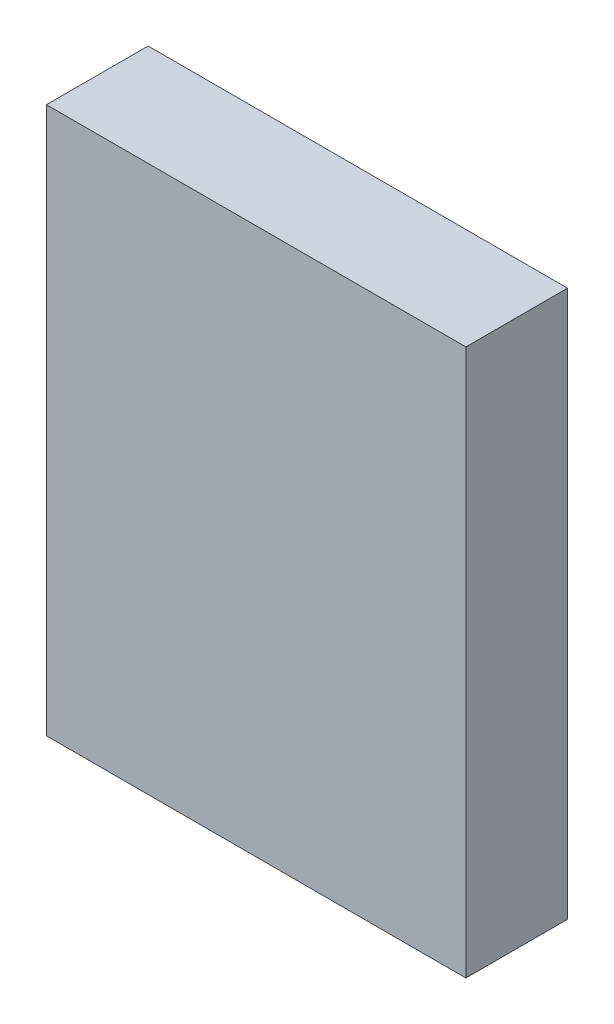
ISO-10303-21;
HEADER;
FILE_DESCRIPTION(('STEP AP214'),'2;1');
FILE_NAME('part.step','',(''),(''),'','','');
FILE_SCHEMA(('AUTOMOTIVE_DESIGN { 1 0 10303 214 1 1 1 1 }'));
ENDSEC;
DATA;
#1=APPLICATION_CONTEXT('core data for automotive mechanical design processes');
#2=APPLICATION_PROTOCOL_DEFINITION('international standard','automotive_design',2000,#1);
#3=PRODUCT_CONTEXT('',#1,'mechanical');
#4=PRODUCT('Part','Part','',(#3));
#5=PRODUCT_RELATED_PRODUCT_CATEGORY('part','',(#4));
#6=PRODUCT_DEFINITION_FORMATION('','',#4);
#7=PRODUCT_DEFINITION_CONTEXT('part definition',#1,'design');
#8=PRODUCT_DEFINITION('design','',#6,#7);
#9=PRODUCT_DEFINITION_SHAPE('','',#8);
#10=(LENGTH_UNIT() NAMED_UNIT(*) SI_UNIT(.MILLI.,.METRE.));
#11=(NAMED_UNIT(*) PLANE_ANGLE_UNIT() SI_UNIT($,.RADIAN.));
#12=(NAMED_UNIT(*) SI_UNIT($,.STERADIAN.) SOLID_ANGLE_UNIT());
#13=UNCERTAINTY_MEASURE_WITH_UNIT(LENGTH_MEASURE(1.E-05),#10,'distance_accuracy_value','');
#14=(GEOMETRIC_REPRESENTATION_CONTEXT(3) GLOBAL_UNCERTAINTY_ASSIGNED_CONTEXT((#13)) GLOBAL_UNIT_ASSIGNED_CONTEXT((#10,
#11,#12)) REPRESENTATION_CONTEXT('',''));
#15=CARTESIAN_POINT('',(0.,0.,0.));
#16=DIRECTION('',(0.,0.,1.));
#17=DIRECTION('',(1.,0.,0.));
#18=AXIS2_PLACEMENT_3D('',#15,#16,#17);
#19=CARTESIAN_POINT('',(0.,0.,12.7));
#20=DIRECTION('',(1.,0.,0.));
#21=DIRECTION('',(0.,0.,-1.));
#22=AXIS2_PLACEMENT_3D('',#19,#20,#21);
#23=PLANE('',#22);
#24=DIRECTION('',(0.,-1.,0.));
#25=VECTOR('',#24,1.);
#26=CARTESIAN_POINT('',(0.,0.,0.));
#27=LINE('',#26,#25);
#28=CARTESIAN_POINT('',(0.,68.2625,0.));
#29=VERTEX_POINT('',#28);
#30=CARTESIAN_POINT('',(0.,0.,0.));
#31=VERTEX_POINT('',#30);
#32=EDGE_CURVE('E100',#29,#31,#27,.T.);
#33=ORIENTED_EDGE('',*,*,#32,.T.);
#34=DIRECTION('',(0.,0.,-1.));
#35=VECTOR('',#34,1.);
#36=CARTESIAN_POINT('',(0.,0.,12.7));
#37=LINE('',#36,#35);
#38=CARTESIAN_POINT('',(0.,0.,12.7));
#39=VERTEX_POINT('',#38);
#40=EDGE_CURVE('E11',#39,#31,#37,.T.);
#41=ORIENTED_EDGE('',*,*,#40,.F.);
#42=DIRECTION('',(0.,-1.,0.));
#43=VECTOR('',#42,1.);
#44=CARTESIAN_POINT('',(0.,0.,12.7));
#45=LINE('',#44,#43);
#46=CARTESIAN_POINT('',(0.,68.2625,12.7));
#47=VERTEX_POINT('',#46);
#48=EDGE_CURVE('E88',#47,#39,#45,.T.);
#49=ORIENTED_EDGE('',*,*,#48,.F.);
#50=DIRECTION('',(0.,0.,-1.));
#51=VECTOR('',#50,1.);
#52=CARTESIAN_POINT('',(0.,68.2625,12.7));
#53=LINE('',#52,#51);
#54=EDGE_CURVE('E96',#47,#29,#53,.T.);
#55=ORIENTED_EDGE('',*,*,#54,.T.);
#56=EDGE_LOOP('',(#33,#41,#49,#55));
#57=FACE_BOUND('',#56,.T.);
#58=ADVANCED_FACE('F37',(#57),#23,.F.);
#59=CARTESIAN_POINT('',(0.,0.,12.7));
#60=DIRECTION('',(0.,1.,0.));
#61=DIRECTION('',(0.,0.,1.));
#62=AXIS2_PLACEMENT_3D('',#59,#60,#61);
#63=PLANE('',#62);
#64=DIRECTION('',(1.,0.,0.));
#65=VECTOR('',#64,1.);
#66=CARTESIAN_POINT('',(0.,0.,0.));
#67=LINE('',#66,#65);
#68=CARTESIAN_POINT('',(52.3875,0.,0.));
#69=VERTEX_POINT('',#68);
#70=EDGE_CURVE('E92',#31,#69,#67,.T.);
#71=ORIENTED_EDGE('',*,*,#70,.T.);
#72=DIRECTION('',(0.,0.,-1.));
#73=VECTOR('',#72,1.);
#74=CARTESIAN_POINT('',(52.3875,0.,12.7));
#75=LINE('',#74,#73);
#76=CARTESIAN_POINT('',(52.3875,0.,12.7));
#77=VERTEX_POINT('',#76);
#78=EDGE_CURVE('E45',#77,#69,#75,.T.);
#79=ORIENTED_EDGE('',*,*,#78,.F.);
#80=DIRECTION('',(1.,0.,0.));
#81=VECTOR('',#80,1.);
#82=CARTESIAN_POINT('',(0.,0.,12.7));
#83=LINE('',#82,#81);
#84=EDGE_CURVE('E83',#39,#77,#83,.T.);
#85=ORIENTED_EDGE('',*,*,#84,.F.);
#86=ORIENTED_EDGE('',*,*,#40,.T.);
#87=EDGE_LOOP('',(#71,#79,#85,#86));
#88=FACE_BOUND('',#87,.T.);
#89=ADVANCED_FACE('F91',(#88),#63,.F.);
#90=CARTESIAN_POINT('',(52.3875,0.,12.7));
#91=DIRECTION('',(-1.,0.,0.));
#92=DIRECTION('',(0.,0.,1.));
#93=AXIS2_PLACEMENT_3D('',#90,#91,#92);
#94=PLANE('',#93);
#95=DIRECTION('',(0.,1.,0.));
#96=VECTOR('',#95,1.);
#97=CARTESIAN_POINT('',(52.3875,0.,0.));
#98=LINE('',#97,#96);
#99=CARTESIAN_POINT('',(52.3875,68.2625,0.));
#100=VERTEX_POINT('',#99);
#101=EDGE_CURVE('E70',#69,#100,#98,.T.);
#102=ORIENTED_EDGE('',*,*,#101,.T.);
#103=DIRECTION('',(0.,0.,-1.));
#104=VECTOR('',#103,1.);
#105=CARTESIAN_POINT('',(52.3875,68.2625,12.7));
#106=LINE('',#105,#104);
#107=CARTESIAN_POINT('',(52.3875,68.2625,12.7));
#108=VERTEX_POINT('',#107);
#109=EDGE_CURVE('E93',#108,#100,#106,.T.);
#110=ORIENTED_EDGE('',*,*,#109,.F.);
#111=DIRECTION('',(0.,1.,0.));
#112=VECTOR('',#111,1.);
#113=CARTESIAN_POINT('',(52.3875,0.,12.7));
#114=LINE('',#113,#112);
#115=EDGE_CURVE('E86',#77,#108,#114,.T.);
#116=ORIENTED_EDGE('',*,*,#115,.F.);
#117=ORIENTED_EDGE('',*,*,#78,.T.);
#118=EDGE_LOOP('',(#102,#110,#116,#117));
#119=FACE_BOUND('',#118,.T.);
#120=ADVANCED_FACE('F94',(#119),#94,.F.);
#121=CARTESIAN_POINT('',(0.,68.2625,12.7));
#122=DIRECTION('',(0.,-1.,0.));
#123=DIRECTION('',(0.,0.,-1.));
#124=AXIS2_PLACEMENT_3D('',#121,#122,#123);
#125=PLANE('',#124);
#126=DIRECTION('',(-1.,0.,0.));
#127=VECTOR('',#126,1.);
#128=CARTESIAN_POINT('',(0.,68.2625,0.));
#129=LINE('',#128,#127);
#130=EDGE_CURVE('E76',#100,#29,#129,.T.);
#131=ORIENTED_EDGE('',*,*,#130,.T.);
#132=ORIENTED_EDGE('',*,*,#54,.F.);
#133=DIRECTION('',(-1.,0.,0.));
#134=VECTOR('',#133,1.);
#135=CARTESIAN_POINT('',(0.,68.2625,12.7));
#136=LINE('',#135,#134);
#137=EDGE_CURVE('E53',#108,#47,#136,.T.);
#138=ORIENTED_EDGE('',*,*,#137,.F.);
#139=ORIENTED_EDGE('',*,*,#109,.T.);
#140=EDGE_LOOP('',(#131,#132,#138,#139));
#141=FACE_BOUND('',#140,.T.);
#142=ADVANCED_FACE('F107',(#141),#125,.F.);
#143=CARTESIAN_POINT('',(0.,0.,12.7));
#144=DIRECTION('',(0.,0.,-1.));
#145=DIRECTION('',(-1.,0.,0.));
#146=AXIS2_PLACEMENT_3D('',#143,#144,#145);
#147=PLANE('',#146);
#148=ORIENTED_EDGE('',*,*,#48,.T.);
#149=ORIENTED_EDGE('',*,*,#84,.T.);
#150=ORIENTED_EDGE('',*,*,#115,.T.);
#151=ORIENTED_EDGE('',*,*,#137,.T.);
#152=EDGE_LOOP('',(#148,#149,#150,#151));
#153=FACE_BOUND('',#152,.T.);
#154=ADVANCED_FACE('F84',(#153),#147,.F.);
#155=CARTESIAN_POINT('',(0.,0.,0.));
#156=DIRECTION('',(0.,0.,-1.));
#157=DIRECTION('',(-1.,0.,0.));
#158=AXIS2_PLACEMENT_3D('',#155,#156,#157);
#159=PLANE('',#158);
#160=ORIENTED_EDGE('',*,*,#32,.F.);
#161=ORIENTED_EDGE('',*,*,#130,.F.);
#162=ORIENTED_EDGE('',*,*,#101,.F.);
#163=ORIENTED_EDGE('',*,*,#70,.F.);
#164=EDGE_LOOP('',(#160,#161,#162,#163));
#165=FACE_BOUND('',#164,.T.);
#166=ADVANCED_FACE('F110',(#165),#159,.T.);
#167=CLOSED_SHELL('',(#58,#89,#120,#142,#154,#166));
#168=MANIFOLD_SOLID_BREP('B2',#167);
#169=ADVANCED_BREP_SHAPE_REPRESENTATION('',(#18,#168),#14);
#170=SHAPE_DEFINITION_REPRESENTATION(#9,#169);
ENDSEC;
END-ISO-10303-21;
